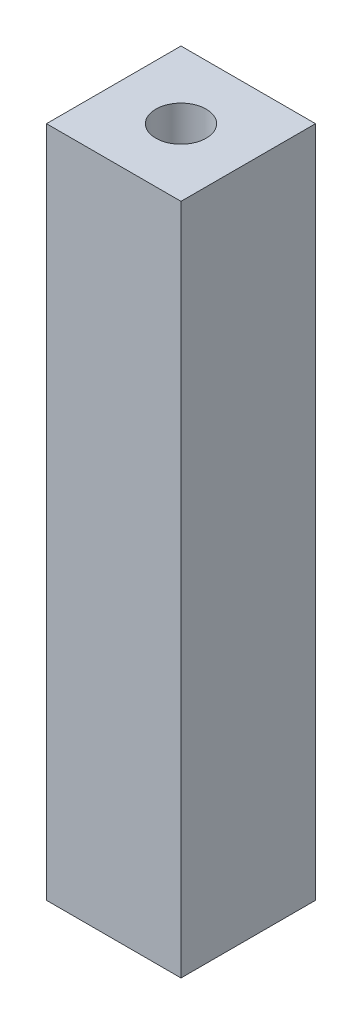
ISO-10303-21;
HEADER;
FILE_DESCRIPTION(('STEP AP214'),'2;1');
FILE_NAME('part.step','',(''),(''),'','','');
FILE_SCHEMA(('AUTOMOTIVE_DESIGN { 1 0 10303 214 1 1 1 1 }'));
ENDSEC;
DATA;
#1=APPLICATION_CONTEXT('core data for automotive mechanical design processes');
#2=APPLICATION_PROTOCOL_DEFINITION('international standard','automotive_design',2000,#1);
#3=PRODUCT_CONTEXT('',#1,'mechanical');
#4=PRODUCT('Part','Part','',(#3));
#5=PRODUCT_RELATED_PRODUCT_CATEGORY('part','',(#4));
#6=PRODUCT_DEFINITION_FORMATION('','',#4);
#7=PRODUCT_DEFINITION_CONTEXT('part definition',#1,'design');
#8=PRODUCT_DEFINITION('design','',#6,#7);
#9=PRODUCT_DEFINITION_SHAPE('','',#8);
#10=(LENGTH_UNIT() NAMED_UNIT(*) SI_UNIT(.MILLI.,.METRE.));
#11=(NAMED_UNIT(*) PLANE_ANGLE_UNIT() SI_UNIT($,.RADIAN.));
#12=(NAMED_UNIT(*) SI_UNIT($,.STERADIAN.) SOLID_ANGLE_UNIT());
#13=UNCERTAINTY_MEASURE_WITH_UNIT(LENGTH_MEASURE(1.E-05),#10,'distance_accuracy_value','');
#14=(GEOMETRIC_REPRESENTATION_CONTEXT(3) GLOBAL_UNCERTAINTY_ASSIGNED_CONTEXT((#13)) GLOBAL_UNIT_ASSIGNED_CONTEXT((#10,
#11,#12)) REPRESENTATION_CONTEXT('',''));
#15=CARTESIAN_POINT('',(0.,0.,0.));
#16=DIRECTION('',(0.,0.,1.));
#17=DIRECTION('',(1.,0.,0.));
#18=AXIS2_PLACEMENT_3D('',#15,#16,#17);
#19=CARTESIAN_POINT('',(4.,40.,4.));
#20=DIRECTION('',(-1.,0.,0.));
#21=DIRECTION('',(0.,0.,1.));
#22=AXIS2_PLACEMENT_3D('',#19,#20,#21);
#23=PLANE('',#22);
#24=DIRECTION('',(0.,0.,-1.));
#25=VECTOR('',#24,1.);
#26=CARTESIAN_POINT('',(4.,0.,4.));
#27=LINE('',#26,#25);
#28=CARTESIAN_POINT('',(4.,0.,4.));
#29=VERTEX_POINT('',#28);
#30=CARTESIAN_POINT('',(4.,0.,-4.));
#31=VERTEX_POINT('',#30);
#32=EDGE_CURVE('E97',#29,#31,#27,.T.);
#33=ORIENTED_EDGE('',*,*,#32,.T.);
#34=DIRECTION('',(0.,-1.,0.));
#35=VECTOR('',#34,1.);
#36=CARTESIAN_POINT('',(4.,40.,-4.));
#37=LINE('',#36,#35);
#38=CARTESIAN_POINT('',(4.,40.,-4.));
#39=VERTEX_POINT('',#38);
#40=EDGE_CURVE('E11',#39,#31,#37,.T.);
#41=ORIENTED_EDGE('',*,*,#40,.F.);
#42=DIRECTION('',(0.,0.,-1.));
#43=VECTOR('',#42,1.);
#44=CARTESIAN_POINT('',(4.,40.,4.));
#45=LINE('',#44,#43);
#46=CARTESIAN_POINT('',(4.,40.,4.));
#47=VERTEX_POINT('',#46);
#48=EDGE_CURVE('E85',#47,#39,#45,.T.);
#49=ORIENTED_EDGE('',*,*,#48,.F.);
#50=DIRECTION('',(0.,-1.,0.));
#51=VECTOR('',#50,1.);
#52=CARTESIAN_POINT('',(4.,40.,4.));
#53=LINE('',#52,#51);
#54=EDGE_CURVE('E93',#47,#29,#53,.T.);
#55=ORIENTED_EDGE('',*,*,#54,.T.);
#56=EDGE_LOOP('',(#33,#41,#49,#55));
#57=FACE_BOUND('',#56,.T.);
#58=ADVANCED_FACE('F34',(#57),#23,.F.);
#59=CARTESIAN_POINT('',(-4.,40.,-4.));
#60=DIRECTION('',(0.,0.,1.));
#61=DIRECTION('',(1.,0.,0.));
#62=AXIS2_PLACEMENT_3D('',#59,#60,#61);
#63=PLANE('',#62);
#64=DIRECTION('',(-1.,0.,0.));
#65=VECTOR('',#64,1.);
#66=CARTESIAN_POINT('',(-4.,0.,-4.));
#67=LINE('',#66,#65);
#68=CARTESIAN_POINT('',(-4.,0.,-4.));
#69=VERTEX_POINT('',#68);
#70=EDGE_CURVE('E89',#31,#69,#67,.T.);
#71=ORIENTED_EDGE('',*,*,#70,.T.);
#72=DIRECTION('',(0.,-1.,0.));
#73=VECTOR('',#72,1.);
#74=CARTESIAN_POINT('',(-4.,40.,-4.));
#75=LINE('',#74,#73);
#76=CARTESIAN_POINT('',(-4.,40.,-4.));
#77=VERTEX_POINT('',#76);
#78=EDGE_CURVE('E42',#77,#69,#75,.T.);
#79=ORIENTED_EDGE('',*,*,#78,.F.);
#80=DIRECTION('',(-1.,0.,0.));
#81=VECTOR('',#80,1.);
#82=CARTESIAN_POINT('',(-4.,40.,-4.));
#83=LINE('',#82,#81);
#84=EDGE_CURVE('E80',#39,#77,#83,.T.);
#85=ORIENTED_EDGE('',*,*,#84,.F.);
#86=ORIENTED_EDGE('',*,*,#40,.T.);
#87=EDGE_LOOP('',(#71,#79,#85,#86));
#88=FACE_BOUND('',#87,.T.);
#89=ADVANCED_FACE('F88',(#88),#63,.F.);
#90=CARTESIAN_POINT('',(-4.,40.,4.));
#91=DIRECTION('',(1.,0.,0.));
#92=DIRECTION('',(0.,0.,-1.));
#93=AXIS2_PLACEMENT_3D('',#90,#91,#92);
#94=PLANE('',#93);
#95=DIRECTION('',(0.,0.,1.));
#96=VECTOR('',#95,1.);
#97=CARTESIAN_POINT('',(-4.,0.,4.));
#98=LINE('',#97,#96);
#99=CARTESIAN_POINT('',(-4.,0.,4.));
#100=VERTEX_POINT('',#99);
#101=EDGE_CURVE('E67',#69,#100,#98,.T.);
#102=ORIENTED_EDGE('',*,*,#101,.T.);
#103=DIRECTION('',(0.,-1.,0.));
#104=VECTOR('',#103,1.);
#105=CARTESIAN_POINT('',(-4.,40.,4.));
#106=LINE('',#105,#104);
#107=CARTESIAN_POINT('',(-4.,40.,4.));
#108=VERTEX_POINT('',#107);
#109=EDGE_CURVE('E90',#108,#100,#106,.T.);
#110=ORIENTED_EDGE('',*,*,#109,.F.);
#111=DIRECTION('',(0.,0.,1.));
#112=VECTOR('',#111,1.);
#113=CARTESIAN_POINT('',(-4.,40.,4.));
#114=LINE('',#113,#112);
#115=EDGE_CURVE('E83',#77,#108,#114,.T.);
#116=ORIENTED_EDGE('',*,*,#115,.F.);
#117=ORIENTED_EDGE('',*,*,#78,.T.);
#118=EDGE_LOOP('',(#102,#110,#116,#117));
#119=FACE_BOUND('',#118,.T.);
#120=ADVANCED_FACE('F91',(#119),#94,.F.);
#121=CARTESIAN_POINT('',(-4.,40.,4.));
#122=DIRECTION('',(0.,0.,-1.));
#123=DIRECTION('',(-1.,0.,0.));
#124=AXIS2_PLACEMENT_3D('',#121,#122,#123);
#125=PLANE('',#124);
#126=DIRECTION('',(1.,0.,0.));
#127=VECTOR('',#126,1.);
#128=CARTESIAN_POINT('',(-4.,0.,4.));
#129=LINE('',#128,#127);
#130=EDGE_CURVE('E73',#100,#29,#129,.T.);
#131=ORIENTED_EDGE('',*,*,#130,.T.);
#132=ORIENTED_EDGE('',*,*,#54,.F.);
#133=DIRECTION('',(1.,0.,0.));
#134=VECTOR('',#133,1.);
#135=CARTESIAN_POINT('',(-4.,40.,4.));
#136=LINE('',#135,#134);
#137=EDGE_CURVE('E50',#108,#47,#136,.T.);
#138=ORIENTED_EDGE('',*,*,#137,.F.);
#139=ORIENTED_EDGE('',*,*,#109,.T.);
#140=EDGE_LOOP('',(#131,#132,#138,#139));
#141=FACE_BOUND('',#140,.T.);
#142=ADVANCED_FACE('F105',(#141),#125,.F.);
#143=CARTESIAN_POINT('',(0.,40.,0.));
#144=DIRECTION('',(0.,-1.,0.));
#145=DIRECTION('',(0.,0.,-1.));
#146=AXIS2_PLACEMENT_3D('',#143,#144,#145);
#147=PLANE('',#146);
#148=CARTESIAN_POINT('',(0.,40.,0.));
#149=DIRECTION('',(0.,1.,0.));
#150=DIRECTION('',(0.,0.,1.));
#151=AXIS2_PLACEMENT_3D('',#148,#149,#150);
#152=CIRCLE('',#151,1.5);
#153=CARTESIAN_POINT('',(0.,40.,1.5));
#154=VERTEX_POINT('',#153);
#155=EDGE_CURVE('E111',#154,#154,#152,.T.);
#156=ORIENTED_EDGE('',*,*,#155,.F.);
#157=EDGE_LOOP('',(#156));
#158=FACE_BOUND('',#157,.T.);
#159=ORIENTED_EDGE('',*,*,#48,.T.);
#160=ORIENTED_EDGE('',*,*,#84,.T.);
#161=ORIENTED_EDGE('',*,*,#115,.T.);
#162=ORIENTED_EDGE('',*,*,#137,.T.);
#163=EDGE_LOOP('',(#159,#160,#161,#162));
#164=FACE_BOUND('',#163,.T.);
#165=ADVANCED_FACE('F81',(#158,#164),#147,.F.);
#166=CARTESIAN_POINT('',(0.,0.,0.));
#167=DIRECTION('',(0.,-1.,0.));
#168=DIRECTION('',(0.,0.,-1.));
#169=AXIS2_PLACEMENT_3D('',#166,#167,#168);
#170=PLANE('',#169);
#171=CARTESIAN_POINT('',(0.,0.,0.));
#172=DIRECTION('',(0.,1.,0.));
#173=DIRECTION('',(0.,0.,1.));
#174=AXIS2_PLACEMENT_3D('',#171,#172,#173);
#175=CIRCLE('',#174,1.5);
#176=CARTESIAN_POINT('',(0.,0.,1.5));
#177=VERTEX_POINT('',#176);
#178=EDGE_CURVE('E100',#177,#177,#175,.T.);
#179=ORIENTED_EDGE('',*,*,#178,.T.);
#180=EDGE_LOOP('',(#179));
#181=FACE_BOUND('',#180,.T.);
#182=ORIENTED_EDGE('',*,*,#32,.F.);
#183=ORIENTED_EDGE('',*,*,#130,.F.);
#184=ORIENTED_EDGE('',*,*,#101,.F.);
#185=ORIENTED_EDGE('',*,*,#70,.F.);
#186=EDGE_LOOP('',(#182,#183,#184,#185));
#187=FACE_BOUND('',#186,.T.);
#188=ADVANCED_FACE('F108',(#181,#187),#170,.T.);
#189=CARTESIAN_POINT('',(0.,0.,0.));
#190=DIRECTION('',(0.,1.,0.));
#191=DIRECTION('',(0.,0.,1.));
#192=AXIS2_PLACEMENT_3D('',#189,#190,#191);
#193=CYLINDRICAL_SURFACE('',#192,1.5);
#194=ORIENTED_EDGE('',*,*,#178,.F.);
#195=EDGE_LOOP('',(#194));
#196=FACE_BOUND('',#195,.T.);
#197=ORIENTED_EDGE('',*,*,#155,.T.);
#198=EDGE_LOOP('',(#197));
#199=FACE_BOUND('',#198,.T.);
#200=ADVANCED_FACE('F118',(#196,#199),#193,.F.);
#201=CLOSED_SHELL('',(#58,#89,#120,#142,#165,#188,#200));
#202=MANIFOLD_SOLID_BREP('B2',#201);
#203=ADVANCED_BREP_SHAPE_REPRESENTATION('',(#18,#202),#14);
#204=SHAPE_DEFINITION_REPRESENTATION(#9,#203);
ENDSEC;
END-ISO-10303-21;
